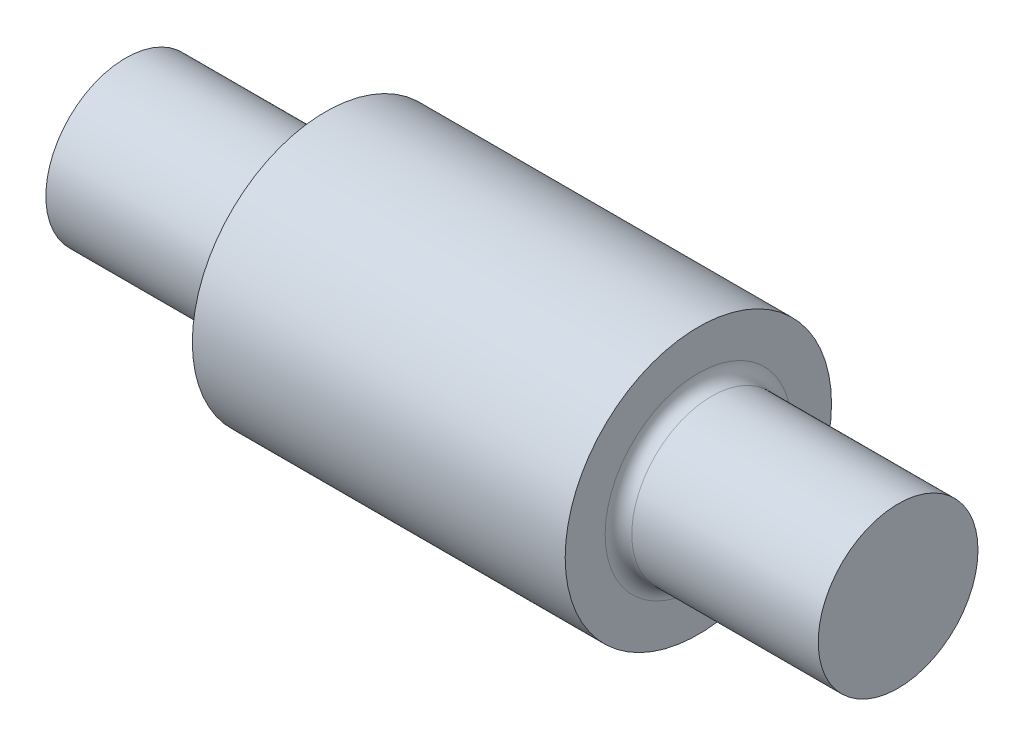
ISO-10303-21;
HEADER;
FILE_DESCRIPTION(('STEP AP214'),'2;1');
FILE_NAME('part.step','',(''),(''),'','','');
FILE_SCHEMA(('AUTOMOTIVE_DESIGN { 1 0 10303 214 1 1 1 1 }'));
ENDSEC;
DATA;
#1=APPLICATION_CONTEXT('core data for automotive mechanical design processes');
#2=APPLICATION_PROTOCOL_DEFINITION('international standard','automotive_design',2000,#1);
#3=PRODUCT_CONTEXT('',#1,'mechanical');
#4=PRODUCT('Part','Part','',(#3));
#5=PRODUCT_RELATED_PRODUCT_CATEGORY('part','',(#4));
#6=PRODUCT_DEFINITION_FORMATION('','',#4);
#7=PRODUCT_DEFINITION_CONTEXT('part definition',#1,'design');
#8=PRODUCT_DEFINITION('design','',#6,#7);
#9=PRODUCT_DEFINITION_SHAPE('','',#8);
#10=(LENGTH_UNIT() NAMED_UNIT(*) SI_UNIT(.MILLI.,.METRE.));
#11=(NAMED_UNIT(*) PLANE_ANGLE_UNIT() SI_UNIT($,.RADIAN.));
#12=(NAMED_UNIT(*) SI_UNIT($,.STERADIAN.) SOLID_ANGLE_UNIT());
#13=UNCERTAINTY_MEASURE_WITH_UNIT(LENGTH_MEASURE(1.E-05),#10,'distance_accuracy_value','');
#14=(GEOMETRIC_REPRESENTATION_CONTEXT(3) GLOBAL_UNCERTAINTY_ASSIGNED_CONTEXT((#13)) GLOBAL_UNIT_ASSIGNED_CONTEXT((#10,
#11,#12)) REPRESENTATION_CONTEXT('',''));
#15=CARTESIAN_POINT('',(0.,0.,0.));
#16=DIRECTION('',(0.,0.,1.));
#17=DIRECTION('',(1.,0.,0.));
#18=AXIS2_PLACEMENT_3D('',#15,#16,#17);
#19=CARTESIAN_POINT('',(14.,0.,0.));
#20=DIRECTION('',(-1.,0.,0.));
#21=DIRECTION('',(0.,0.,1.));
#22=AXIS2_PLACEMENT_3D('',#19,#20,#21);
#23=CYLINDRICAL_SURFACE('',#22,10.);
#24=CARTESIAN_POINT('',(14.,0.,0.));
#25=DIRECTION('',(1.,0.,0.));
#26=DIRECTION('',(0.,0.,-1.));
#27=AXIS2_PLACEMENT_3D('',#24,#25,#26);
#28=CIRCLE('',#27,10.);
#29=CARTESIAN_POINT('',(14.,0.,-10.));
#30=VERTEX_POINT('',#29);
#31=EDGE_CURVE('E50',#30,#30,#28,.T.);
#32=ORIENTED_EDGE('',*,*,#31,.F.);
#33=EDGE_LOOP('',(#32));
#34=FACE_BOUND('',#33,.T.);
#35=CARTESIAN_POINT('',(-14.,0.,0.));
#36=DIRECTION('',(1.,0.,0.));
#37=DIRECTION('',(0.,0.,-1.));
#38=AXIS2_PLACEMENT_3D('',#35,#36,#37);
#39=CIRCLE('',#38,10.);
#40=CARTESIAN_POINT('',(-14.,0.,-10.));
#41=VERTEX_POINT('',#40);
#42=EDGE_CURVE('E51',#41,#41,#39,.T.);
#43=ORIENTED_EDGE('',*,*,#42,.T.);
#44=EDGE_LOOP('',(#43));
#45=FACE_BOUND('',#44,.T.);
#46=ADVANCED_FACE('F30',(#34,#45),#23,.T.);
#47=CARTESIAN_POINT('',(14.,0.,0.));
#48=DIRECTION('',(1.,0.,0.));
#49=DIRECTION('',(0.,0.,-1.));
#50=AXIS2_PLACEMENT_3D('',#47,#48,#49);
#51=PLANE('',#50);
#52=CARTESIAN_POINT('',(14.,0.,0.));
#53=DIRECTION('',(1.,0.,0.));
#54=DIRECTION('',(0.,0.,-1.));
#55=AXIS2_PLACEMENT_3D('',#52,#53,#54);
#56=CIRCLE('',#55,7.);
#57=CARTESIAN_POINT('',(14.,0.,-7.));
#58=VERTEX_POINT('',#57);
#59=EDGE_CURVE('E41',#58,#58,#56,.F.);
#60=ORIENTED_EDGE('',*,*,#59,.T.);
#61=EDGE_LOOP('',(#60));
#62=FACE_BOUND('',#61,.T.);
#63=ORIENTED_EDGE('',*,*,#31,.T.);
#64=EDGE_LOOP('',(#63));
#65=FACE_BOUND('',#64,.T.);
#66=ADVANCED_FACE('F77',(#62,#65),#51,.T.);
#67=CARTESIAN_POINT('',(-14.,0.,0.));
#68=DIRECTION('',(1.,0.,0.));
#69=DIRECTION('',(0.,0.,-1.));
#70=AXIS2_PLACEMENT_3D('',#67,#68,#69);
#71=PLANE('',#70);
#72=CARTESIAN_POINT('',(-14.,0.,0.));
#73=DIRECTION('',(1.,0.,0.));
#74=DIRECTION('',(0.,0.,-1.));
#75=AXIS2_PLACEMENT_3D('',#72,#73,#74);
#76=CIRCLE('',#75,7.);
#77=CARTESIAN_POINT('',(-14.,0.,-7.));
#78=VERTEX_POINT('',#77);
#79=EDGE_CURVE('E37',#78,#78,#76,.T.);
#80=ORIENTED_EDGE('',*,*,#79,.T.);
#81=EDGE_LOOP('',(#80));
#82=FACE_BOUND('',#81,.T.);
#83=ORIENTED_EDGE('',*,*,#42,.F.);
#84=EDGE_LOOP('',(#83));
#85=FACE_BOUND('',#84,.T.);
#86=ADVANCED_FACE('F83',(#82,#85),#71,.F.);
#87=CARTESIAN_POINT('',(29.,0.,0.));
#88=DIRECTION('',(-1.,0.,0.));
#89=DIRECTION('',(0.,0.,1.));
#90=AXIS2_PLACEMENT_3D('',#87,#88,#89);
#91=CYLINDRICAL_SURFACE('',#90,6.);
#92=CARTESIAN_POINT('',(15.,0.,0.));
#93=DIRECTION('',(1.,0.,0.));
#94=DIRECTION('',(0.,0.,-1.));
#95=AXIS2_PLACEMENT_3D('',#92,#93,#94);
#96=CIRCLE('',#95,6.);
#97=CARTESIAN_POINT('',(15.,0.,-6.));
#98=VERTEX_POINT('',#97);
#99=EDGE_CURVE('E45',#98,#98,#96,.T.);
#100=ORIENTED_EDGE('',*,*,#99,.T.);
#101=EDGE_LOOP('',(#100));
#102=FACE_BOUND('',#101,.T.);
#103=CARTESIAN_POINT('',(29.,0.,0.));
#104=DIRECTION('',(1.,0.,0.));
#105=DIRECTION('',(0.,0.,-1.));
#106=AXIS2_PLACEMENT_3D('',#103,#104,#105);
#107=CIRCLE('',#106,6.);
#108=CARTESIAN_POINT('',(29.,0.,-6.));
#109=VERTEX_POINT('',#108);
#110=EDGE_CURVE('E54',#109,#109,#107,.T.);
#111=ORIENTED_EDGE('',*,*,#110,.F.);
#112=EDGE_LOOP('',(#111));
#113=FACE_BOUND('',#112,.T.);
#114=ADVANCED_FACE('F90',(#102,#113),#91,.T.);
#115=CARTESIAN_POINT('',(29.,0.,0.));
#116=DIRECTION('',(1.,0.,0.));
#117=DIRECTION('',(0.,0.,-1.));
#118=AXIS2_PLACEMENT_3D('',#115,#116,#117);
#119=PLANE('',#118);
#120=ORIENTED_EDGE('',*,*,#110,.T.);
#121=EDGE_LOOP('',(#120));
#122=FACE_BOUND('',#121,.T.);
#123=ADVANCED_FACE('F74',(#122),#119,.T.);
#124=CARTESIAN_POINT('',(-29.,0.,0.));
#125=DIRECTION('',(1.,0.,0.));
#126=DIRECTION('',(0.,0.,-1.));
#127=AXIS2_PLACEMENT_3D('',#124,#125,#126);
#128=CYLINDRICAL_SURFACE('',#127,6.);
#129=CARTESIAN_POINT('',(-15.,0.,0.));
#130=DIRECTION('',(1.,0.,0.));
#131=DIRECTION('',(0.,0.,-1.));
#132=AXIS2_PLACEMENT_3D('',#129,#130,#131);
#133=CIRCLE('',#132,6.);
#134=CARTESIAN_POINT('',(-15.,0.,-6.));
#135=VERTEX_POINT('',#134);
#136=EDGE_CURVE('E10',#135,#135,#133,.F.);
#137=ORIENTED_EDGE('',*,*,#136,.T.);
#138=EDGE_LOOP('',(#137));
#139=FACE_BOUND('',#138,.T.);
#140=CARTESIAN_POINT('',(-29.,0.,0.));
#141=DIRECTION('',(1.,0.,0.));
#142=DIRECTION('',(0.,0.,-1.));
#143=AXIS2_PLACEMENT_3D('',#140,#141,#142);
#144=CIRCLE('',#143,6.);
#145=CARTESIAN_POINT('',(-29.,0.,-6.));
#146=VERTEX_POINT('',#145);
#147=EDGE_CURVE('E59',#146,#146,#144,.T.);
#148=ORIENTED_EDGE('',*,*,#147,.T.);
#149=EDGE_LOOP('',(#148));
#150=FACE_BOUND('',#149,.T.);
#151=ADVANCED_FACE('F63',(#139,#150),#128,.T.);
#152=CARTESIAN_POINT('',(-29.,0.,0.));
#153=DIRECTION('',(-1.,0.,0.));
#154=DIRECTION('',(0.,0.,-1.));
#155=AXIS2_PLACEMENT_3D('',#152,#153,#154);
#156=PLANE('',#155);
#157=ORIENTED_EDGE('',*,*,#147,.F.);
#158=EDGE_LOOP('',(#157));
#159=FACE_BOUND('',#158,.T.);
#160=ADVANCED_FACE('F65',(#159),#156,.T.);
#161=CARTESIAN_POINT('',(15.,0.,0.));
#162=DIRECTION('',(1.,0.,0.));
#163=DIRECTION('',(0.,0.,-1.));
#164=AXIS2_PLACEMENT_3D('',#161,#162,#163);
#165=TOROIDAL_SURFACE('',#164,7.,1.);
#166=ORIENTED_EDGE('',*,*,#59,.F.);
#167=EDGE_LOOP('',(#166));
#168=FACE_BOUND('',#167,.T.);
#169=ORIENTED_EDGE('',*,*,#99,.F.);
#170=EDGE_LOOP('',(#169));
#171=FACE_BOUND('',#170,.T.);
#172=ADVANCED_FACE('F67',(#168,#171),#165,.F.);
#173=CARTESIAN_POINT('',(-15.,0.,0.));
#174=DIRECTION('',(1.,0.,0.));
#175=DIRECTION('',(0.,0.,-1.));
#176=AXIS2_PLACEMENT_3D('',#173,#174,#175);
#177=TOROIDAL_SURFACE('',#176,7.,1.);
#178=ORIENTED_EDGE('',*,*,#136,.F.);
#179=EDGE_LOOP('',(#178));
#180=FACE_BOUND('',#179,.T.);
#181=ORIENTED_EDGE('',*,*,#79,.F.);
#182=EDGE_LOOP('',(#181));
#183=FACE_BOUND('',#182,.T.);
#184=ADVANCED_FACE('F32',(#180,#183),#177,.F.);
#185=CLOSED_SHELL('',(#46,#66,#86,#114,#123,#151,#160,#172,#184));
#186=MANIFOLD_SOLID_BREP('B2',#185);
#187=ADVANCED_BREP_SHAPE_REPRESENTATION('',(#18,#186),#14);
#188=SHAPE_DEFINITION_REPRESENTATION(#9,#187);
ENDSEC;
END-ISO-10303-21;
